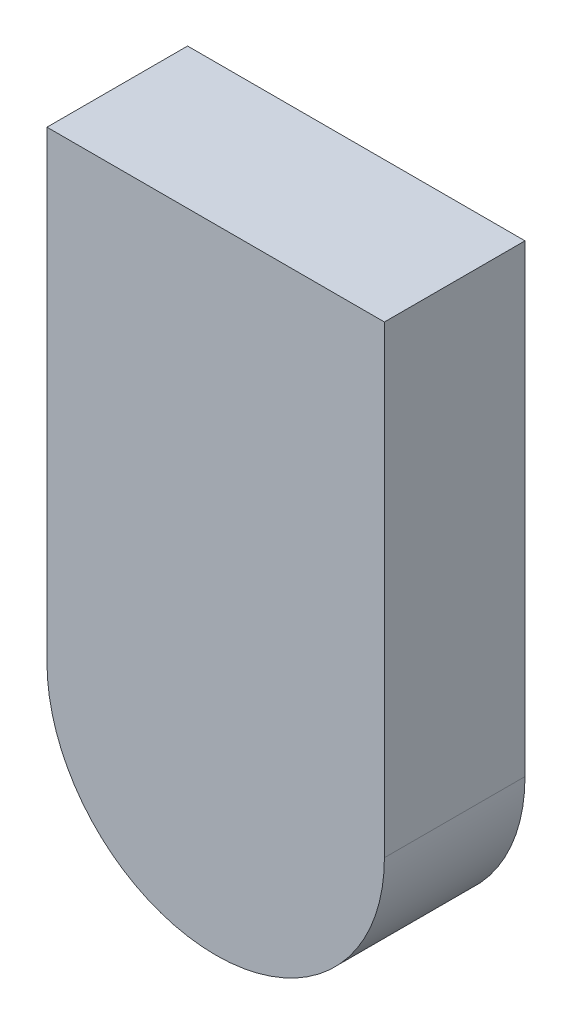
ISO-10303-21;
HEADER;
FILE_DESCRIPTION(('STEP AP214'),'2;1');
FILE_NAME('part.step','',(''),(''),'','','');
FILE_SCHEMA(('AUTOMOTIVE_DESIGN { 1 0 10303 214 1 1 1 1 }'));
ENDSEC;
DATA;
#1=APPLICATION_CONTEXT('core data for automotive mechanical design processes');
#2=APPLICATION_PROTOCOL_DEFINITION('international standard','automotive_design',2000,#1);
#3=PRODUCT_CONTEXT('',#1,'mechanical');
#4=PRODUCT('Part','Part','',(#3));
#5=PRODUCT_RELATED_PRODUCT_CATEGORY('part','',(#4));
#6=PRODUCT_DEFINITION_FORMATION('','',#4);
#7=PRODUCT_DEFINITION_CONTEXT('part definition',#1,'design');
#8=PRODUCT_DEFINITION('design','',#6,#7);
#9=PRODUCT_DEFINITION_SHAPE('','',#8);
#10=(LENGTH_UNIT() NAMED_UNIT(*) SI_UNIT(.MILLI.,.METRE.));
#11=(NAMED_UNIT(*) PLANE_ANGLE_UNIT() SI_UNIT($,.RADIAN.));
#12=(NAMED_UNIT(*) SI_UNIT($,.STERADIAN.) SOLID_ANGLE_UNIT());
#13=UNCERTAINTY_MEASURE_WITH_UNIT(LENGTH_MEASURE(1.E-05),#10,'distance_accuracy_value','');
#14=(GEOMETRIC_REPRESENTATION_CONTEXT(3) GLOBAL_UNCERTAINTY_ASSIGNED_CONTEXT((#13)) GLOBAL_UNIT_ASSIGNED_CONTEXT((#10,
#11,#12)) REPRESENTATION_CONTEXT('',''));
#15=CARTESIAN_POINT('',(0.,0.,0.));
#16=DIRECTION('',(0.,0.,1.));
#17=DIRECTION('',(1.,0.,0.));
#18=AXIS2_PLACEMENT_3D('',#15,#16,#17);
#19=CARTESIAN_POINT('',(3.13,4.05,0.));
#20=DIRECTION('',(0.,1.,0.));
#21=DIRECTION('',(1.,0.,0.));
#22=AXIS2_PLACEMENT_3D('',#19,#20,#21);
#23=PLANE('',#22);
#24=DIRECTION('',(0.,0.,1.));
#25=VECTOR('',#24,1.);
#26=CARTESIAN_POINT('',(3.13,4.05,0.));
#27=LINE('',#26,#25);
#28=CARTESIAN_POINT('',(3.13,4.05,0.));
#29=VERTEX_POINT('',#28);
#30=CARTESIAN_POINT('',(3.13,4.05,0.1));
#31=VERTEX_POINT('',#30);
#32=EDGE_CURVE('E11',#29,#31,#27,.T.);
#33=ORIENTED_EDGE('',*,*,#32,.T.);
#34=DIRECTION('',(1.,0.,0.));
#35=VECTOR('',#34,1.);
#36=CARTESIAN_POINT('',(3.13,4.05,0.1));
#37=LINE('',#36,#35);
#38=CARTESIAN_POINT('',(3.37,4.05,0.1));
#39=VERTEX_POINT('',#38);
#40=EDGE_CURVE('E24',#31,#39,#37,.T.);
#41=ORIENTED_EDGE('',*,*,#40,.T.);
#42=DIRECTION('',(0.,0.,1.));
#43=VECTOR('',#42,1.);
#44=CARTESIAN_POINT('',(3.37,4.05,0.));
#45=LINE('',#44,#43);
#46=CARTESIAN_POINT('',(3.37,4.05,0.));
#47=VERTEX_POINT('',#46);
#48=EDGE_CURVE('E85',#47,#39,#45,.T.);
#49=ORIENTED_EDGE('',*,*,#48,.F.);
#50=DIRECTION('',(1.,0.,0.));
#51=VECTOR('',#50,1.);
#52=CARTESIAN_POINT('',(3.13,4.05,0.));
#53=LINE('',#52,#51);
#54=EDGE_CURVE('E82',#29,#47,#53,.T.);
#55=ORIENTED_EDGE('',*,*,#54,.F.);
#56=EDGE_LOOP('',(#33,#41,#49,#55));
#57=FACE_BOUND('',#56,.T.);
#58=ADVANCED_FACE('F17',(#57),#23,.T.);
#59=CARTESIAN_POINT('',(3.37,4.05,0.));
#60=DIRECTION('',(1.,0.,0.));
#61=DIRECTION('',(0.,-1.,0.));
#62=AXIS2_PLACEMENT_3D('',#59,#60,#61);
#63=PLANE('',#62);
#64=ORIENTED_EDGE('',*,*,#48,.T.);
#65=DIRECTION('',(0.,-1.,0.));
#66=VECTOR('',#65,1.);
#67=CARTESIAN_POINT('',(3.37,4.05,0.1));
#68=LINE('',#67,#66);
#69=CARTESIAN_POINT('',(3.37,3.72,0.1));
#70=VERTEX_POINT('',#69);
#71=EDGE_CURVE('E80',#39,#70,#68,.T.);
#72=ORIENTED_EDGE('',*,*,#71,.T.);
#73=DIRECTION('',(0.,0.,1.));
#74=VECTOR('',#73,1.);
#75=CARTESIAN_POINT('',(3.37,3.72,0.));
#76=LINE('',#75,#74);
#77=CARTESIAN_POINT('',(3.37,3.72,0.));
#78=VERTEX_POINT('',#77);
#79=EDGE_CURVE('E60',#78,#70,#76,.T.);
#80=ORIENTED_EDGE('',*,*,#79,.F.);
#81=DIRECTION('',(0.,-1.,0.));
#82=VECTOR('',#81,1.);
#83=CARTESIAN_POINT('',(3.37,4.05,0.));
#84=LINE('',#83,#82);
#85=EDGE_CURVE('E76',#47,#78,#84,.T.);
#86=ORIENTED_EDGE('',*,*,#85,.F.);
#87=EDGE_LOOP('',(#64,#72,#80,#86));
#88=FACE_BOUND('',#87,.T.);
#89=ADVANCED_FACE('F89',(#88),#63,.T.);
#90=CARTESIAN_POINT('',(3.25,3.72,0.));
#91=DIRECTION('',(0.,0.,-1.));
#92=DIRECTION('',(1.,0.,0.));
#93=AXIS2_PLACEMENT_3D('',#90,#91,#92);
#94=CYLINDRICAL_SURFACE('',#93,0.12);
#95=CARTESIAN_POINT('',(3.25,3.72,0.));
#96=DIRECTION('',(0.,0.,1.));
#97=DIRECTION('',(1.,0.,0.));
#98=AXIS2_PLACEMENT_3D('',#95,#96,#97);
#99=CIRCLE('',#98,0.12);
#100=CARTESIAN_POINT('',(3.13,3.72,0.));
#101=VERTEX_POINT('',#100);
#102=EDGE_CURVE('E64',#101,#78,#99,.T.);
#103=ORIENTED_EDGE('',*,*,#102,.T.);
#104=ORIENTED_EDGE('',*,*,#79,.T.);
#105=CARTESIAN_POINT('',(3.25,3.72,0.1));
#106=DIRECTION('',(0.,0.,1.));
#107=DIRECTION('',(1.,0.,0.));
#108=AXIS2_PLACEMENT_3D('',#105,#106,#107);
#109=CIRCLE('',#108,0.12);
#110=CARTESIAN_POINT('',(3.13,3.72,0.1));
#111=VERTEX_POINT('',#110);
#112=EDGE_CURVE('E55',#111,#70,#109,.T.);
#113=ORIENTED_EDGE('',*,*,#112,.F.);
#114=DIRECTION('',(0.,0.,1.));
#115=VECTOR('',#114,1.);
#116=CARTESIAN_POINT('',(3.13,3.72,0.));
#117=LINE('',#116,#115);
#118=EDGE_CURVE('E59',#101,#111,#117,.T.);
#119=ORIENTED_EDGE('',*,*,#118,.F.);
#120=EDGE_LOOP('',(#103,#104,#113,#119));
#121=FACE_BOUND('',#120,.T.);
#122=ADVANCED_FACE('F58',(#121),#94,.T.);
#123=CARTESIAN_POINT('',(3.13,4.05,0.));
#124=DIRECTION('',(1.,0.,0.));
#125=DIRECTION('',(0.,-1.,0.));
#126=AXIS2_PLACEMENT_3D('',#123,#124,#125);
#127=PLANE('',#126);
#128=DIRECTION('',(0.,-1.,0.));
#129=VECTOR('',#128,1.);
#130=CARTESIAN_POINT('',(3.13,4.05,0.));
#131=LINE('',#130,#129);
#132=EDGE_CURVE('E69',#29,#101,#131,.T.);
#133=ORIENTED_EDGE('',*,*,#132,.T.);
#134=ORIENTED_EDGE('',*,*,#118,.T.);
#135=DIRECTION('',(0.,-1.,0.));
#136=VECTOR('',#135,1.);
#137=CARTESIAN_POINT('',(3.13,4.05,0.1));
#138=LINE('',#137,#136);
#139=EDGE_CURVE('E67',#31,#111,#138,.T.);
#140=ORIENTED_EDGE('',*,*,#139,.F.);
#141=ORIENTED_EDGE('',*,*,#32,.F.);
#142=EDGE_LOOP('',(#133,#134,#140,#141));
#143=FACE_BOUND('',#142,.T.);
#144=ADVANCED_FACE('F66',(#143),#127,.F.);
#145=CARTESIAN_POINT('',(3.25,3.849490847913,0.));
#146=DIRECTION('',(0.,0.,-1.));
#147=DIRECTION('',(-1.,0.,0.));
#148=AXIS2_PLACEMENT_3D('',#145,#146,#147);
#149=PLANE('',#148);
#150=ORIENTED_EDGE('',*,*,#54,.T.);
#151=ORIENTED_EDGE('',*,*,#85,.T.);
#152=ORIENTED_EDGE('',*,*,#102,.F.);
#153=ORIENTED_EDGE('',*,*,#132,.F.);
#154=EDGE_LOOP('',(#150,#151,#152,#153));
#155=FACE_BOUND('',#154,.T.);
#156=ADVANCED_FACE('F91',(#155),#149,.T.);
#157=CARTESIAN_POINT('',(3.25,3.849490847913,0.1));
#158=DIRECTION('',(0.,0.,-1.));
#159=DIRECTION('',(-1.,0.,0.));
#160=AXIS2_PLACEMENT_3D('',#157,#158,#159);
#161=PLANE('',#160);
#162=ORIENTED_EDGE('',*,*,#139,.T.);
#163=ORIENTED_EDGE('',*,*,#112,.T.);
#164=ORIENTED_EDGE('',*,*,#71,.F.);
#165=ORIENTED_EDGE('',*,*,#40,.F.);
#166=EDGE_LOOP('',(#162,#163,#164,#165));
#167=FACE_BOUND('',#166,.T.);
#168=ADVANCED_FACE('F71',(#167),#161,.F.);
#169=CLOSED_SHELL('',(#58,#89,#122,#144,#156,#168));
#170=MANIFOLD_SOLID_BREP('B1',#169);
#171=ADVANCED_BREP_SHAPE_REPRESENTATION('',(#18,#170),#14);
#172=SHAPE_DEFINITION_REPRESENTATION(#9,#171);
ENDSEC;
END-ISO-10303-21;
